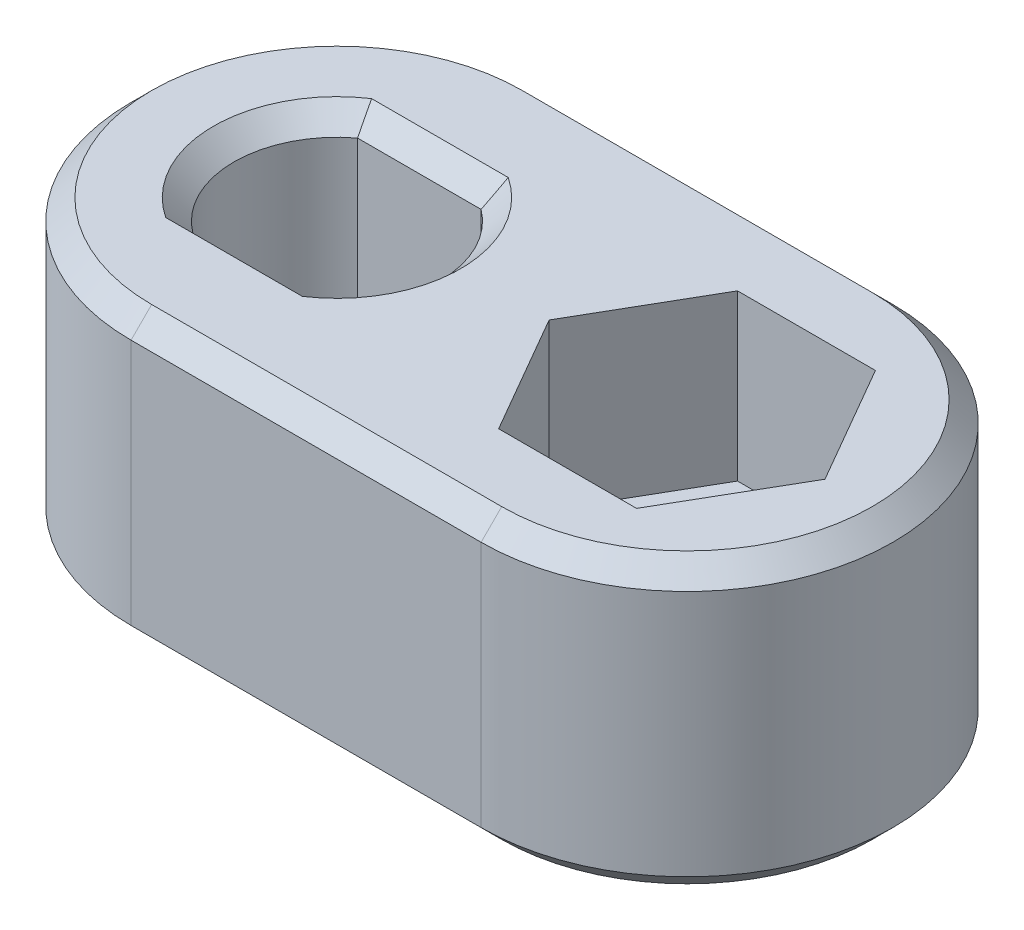
ISO-10303-21;
HEADER;
FILE_DESCRIPTION(('STEP AP214'),'2;1');
FILE_NAME('part.step','',(''),(''),'','','');
FILE_SCHEMA(('AUTOMOTIVE_DESIGN { 1 0 10303 214 1 1 1 1 }'));
ENDSEC;
DATA;
#1=APPLICATION_CONTEXT('core data for automotive mechanical design processes');
#2=APPLICATION_PROTOCOL_DEFINITION('international standard','automotive_design',2000,#1);
#3=PRODUCT_CONTEXT('',#1,'mechanical');
#4=PRODUCT('Part','Part','',(#3));
#5=PRODUCT_RELATED_PRODUCT_CATEGORY('part','',(#4));
#6=PRODUCT_DEFINITION_FORMATION('','',#4);
#7=PRODUCT_DEFINITION_CONTEXT('part definition',#1,'design');
#8=PRODUCT_DEFINITION('design','',#6,#7);
#9=PRODUCT_DEFINITION_SHAPE('','',#8);
#10=(LENGTH_UNIT() NAMED_UNIT(*) SI_UNIT(.MILLI.,.METRE.));
#11=(NAMED_UNIT(*) PLANE_ANGLE_UNIT() SI_UNIT($,.RADIAN.));
#12=(NAMED_UNIT(*) SI_UNIT($,.STERADIAN.) SOLID_ANGLE_UNIT());
#13=UNCERTAINTY_MEASURE_WITH_UNIT(LENGTH_MEASURE(1.E-05),#10,'distance_accuracy_value','');
#14=(GEOMETRIC_REPRESENTATION_CONTEXT(3) GLOBAL_UNCERTAINTY_ASSIGNED_CONTEXT((#13)) GLOBAL_UNIT_ASSIGNED_CONTEXT((#10,
#11,#12)) REPRESENTATION_CONTEXT('',''));
#15=CARTESIAN_POINT('',(0.,0.,0.));
#16=DIRECTION('',(0.,0.,1.));
#17=DIRECTION('',(1.,0.,0.));
#18=AXIS2_PLACEMENT_3D('',#15,#16,#17);
#19=CARTESIAN_POINT('',(8.5,0.,0.));
#20=DIRECTION('',(0.,-1.,0.));
#21=DIRECTION('',(0.,0.,-1.));
#22=AXIS2_PLACEMENT_3D('',#19,#20,#21);
#23=CYLINDRICAL_SURFACE('',#22,2.07500000000001);
#24=CARTESIAN_POINT('',(8.5,0.,0.));
#25=DIRECTION('',(0.,-1.,0.));
#26=DIRECTION('',(0.,0.,-1.));
#27=AXIS2_PLACEMENT_3D('',#24,#25,#26);
#28=CIRCLE('',#27,2.07500000000001);
#29=CARTESIAN_POINT('',(8.5,0.,-2.07500000000001));
#30=VERTEX_POINT('',#29);
#31=EDGE_CURVE('E236',#30,#30,#28,.T.);
#32=ORIENTED_EDGE('',*,*,#31,.T.);
#33=EDGE_LOOP('',(#32));
#34=FACE_BOUND('',#33,.T.);
#35=CARTESIAN_POINT('',(8.5,3.,0.));
#36=DIRECTION('',(0.,1.,0.));
#37=DIRECTION('',(0.,0.,1.));
#38=AXIS2_PLACEMENT_3D('',#35,#36,#37);
#39=CIRCLE('',#38,2.07500000000001);
#40=CARTESIAN_POINT('',(8.5,3.,2.07500000000001));
#41=VERTEX_POINT('',#40);
#42=EDGE_CURVE('E228',#41,#41,#39,.F.);
#43=ORIENTED_EDGE('',*,*,#42,.F.);
#44=EDGE_LOOP('',(#43));
#45=FACE_BOUND('',#44,.T.);
#46=ADVANCED_FACE('F35',(#34,#45),#23,.F.);
#47=CARTESIAN_POINT('',(0.,7.,0.));
#48=DIRECTION('',(0.,-1.,0.));
#49=DIRECTION('',(0.,0.,-1.));
#50=AXIS2_PLACEMENT_3D('',#47,#48,#49);
#51=CYLINDRICAL_SURFACE('',#50,5.);
#52=DIRECTION('',(0.,-1.,0.));
#53=VECTOR('',#52,1.);
#54=CARTESIAN_POINT('',(0.,7.,5.));
#55=LINE('',#54,#53);
#56=CARTESIAN_POINT('',(0.,6.5,5.));
#57=VERTEX_POINT('',#56);
#58=CARTESIAN_POINT('',(0.,0.500000000000005,5.));
#59=VERTEX_POINT('',#58);
#60=EDGE_CURVE('E276',#57,#59,#55,.T.);
#61=ORIENTED_EDGE('',*,*,#60,.F.);
#62=CARTESIAN_POINT('',(0.,6.5,0.));
#63=DIRECTION('',(0.,1.,0.));
#64=DIRECTION('',(0.,0.,1.));
#65=AXIS2_PLACEMENT_3D('',#62,#63,#64);
#66=CIRCLE('',#65,5.);
#67=CARTESIAN_POINT('',(0.,6.5,-5.));
#68=VERTEX_POINT('',#67);
#69=EDGE_CURVE('E312',#57,#68,#66,.F.);
#70=ORIENTED_EDGE('',*,*,#69,.T.);
#71=DIRECTION('',(0.,-1.,0.));
#72=VECTOR('',#71,1.);
#73=CARTESIAN_POINT('',(0.,7.,-5.));
#74=LINE('',#73,#72);
#75=CARTESIAN_POINT('',(0.,0.500000000000005,-5.));
#76=VERTEX_POINT('',#75);
#77=EDGE_CURVE('E259',#68,#76,#74,.T.);
#78=ORIENTED_EDGE('',*,*,#77,.T.);
#79=CARTESIAN_POINT('',(0.,0.500000000000005,0.));
#80=DIRECTION('',(0.,1.,0.));
#81=DIRECTION('',(0.,0.,1.));
#82=AXIS2_PLACEMENT_3D('',#79,#80,#81);
#83=CIRCLE('',#82,5.);
#84=EDGE_CURVE('E310',#76,#59,#83,.T.);
#85=ORIENTED_EDGE('',*,*,#84,.T.);
#86=EDGE_LOOP('',(#61,#70,#78,#85));
#87=FACE_BOUND('',#86,.T.);
#88=ADVANCED_FACE('F438',(#87),#51,.T.);
#89=CARTESIAN_POINT('',(0.,7.,5.));
#90=DIRECTION('',(0.,0.,-1.));
#91=DIRECTION('',(-1.,0.,0.));
#92=AXIS2_PLACEMENT_3D('',#89,#90,#91);
#93=PLANE('',#92);
#94=DIRECTION('',(0.,-1.,0.));
#95=VECTOR('',#94,1.);
#96=CARTESIAN_POINT('',(8.5,7.,5.));
#97=LINE('',#96,#95);
#98=CARTESIAN_POINT('',(8.5,6.5,5.));
#99=VERTEX_POINT('',#98);
#100=CARTESIAN_POINT('',(8.5,0.500000000000005,5.));
#101=VERTEX_POINT('',#100);
#102=EDGE_CURVE('E273',#99,#101,#97,.T.);
#103=ORIENTED_EDGE('',*,*,#102,.F.);
#104=DIRECTION('',(-1.,0.,0.));
#105=VECTOR('',#104,1.);
#106=CARTESIAN_POINT('',(0.,6.5,5.));
#107=LINE('',#106,#105);
#108=EDGE_CURVE('E317',#99,#57,#107,.T.);
#109=ORIENTED_EDGE('',*,*,#108,.T.);
#110=ORIENTED_EDGE('',*,*,#60,.T.);
#111=DIRECTION('',(1.,0.,0.));
#112=VECTOR('',#111,1.);
#113=CARTESIAN_POINT('',(0.,0.500000000000005,5.));
#114=LINE('',#113,#112);
#115=EDGE_CURVE('E315',#59,#101,#114,.T.);
#116=ORIENTED_EDGE('',*,*,#115,.T.);
#117=EDGE_LOOP('',(#103,#109,#110,#116));
#118=FACE_BOUND('',#117,.T.);
#119=ADVANCED_FACE('F445',(#118),#93,.F.);
#120=CARTESIAN_POINT('',(8.5,7.,0.));
#121=DIRECTION('',(0.,-1.,0.));
#122=DIRECTION('',(0.,0.,-1.));
#123=AXIS2_PLACEMENT_3D('',#120,#121,#122);
#124=CYLINDRICAL_SURFACE('',#123,5.);
#125=DIRECTION('',(0.,-1.,0.));
#126=VECTOR('',#125,1.);
#127=CARTESIAN_POINT('',(8.5,7.,-5.));
#128=LINE('',#127,#126);
#129=CARTESIAN_POINT('',(8.5,6.5,-5.));
#130=VERTEX_POINT('',#129);
#131=CARTESIAN_POINT('',(8.5,0.500000000000005,-5.));
#132=VERTEX_POINT('',#131);
#133=EDGE_CURVE('E270',#130,#132,#128,.T.);
#134=ORIENTED_EDGE('',*,*,#133,.F.);
#135=CARTESIAN_POINT('',(8.5,6.5,0.));
#136=DIRECTION('',(0.,1.,0.));
#137=DIRECTION('',(0.,0.,1.));
#138=AXIS2_PLACEMENT_3D('',#135,#136,#137);
#139=CIRCLE('',#138,5.);
#140=EDGE_CURVE('E326',#130,#99,#139,.F.);
#141=ORIENTED_EDGE('',*,*,#140,.T.);
#142=ORIENTED_EDGE('',*,*,#102,.T.);
#143=CARTESIAN_POINT('',(8.5,0.500000000000005,0.));
#144=DIRECTION('',(0.,1.,0.));
#145=DIRECTION('',(0.,0.,1.));
#146=AXIS2_PLACEMENT_3D('',#143,#144,#145);
#147=CIRCLE('',#146,5.);
#148=EDGE_CURVE('E323',#101,#132,#147,.T.);
#149=ORIENTED_EDGE('',*,*,#148,.T.);
#150=EDGE_LOOP('',(#134,#141,#142,#149));
#151=FACE_BOUND('',#150,.T.);
#152=ADVANCED_FACE('F486',(#151),#124,.T.);
#153=CARTESIAN_POINT('',(0.,7.,-5.));
#154=DIRECTION('',(0.,0.,1.));
#155=DIRECTION('',(1.,0.,0.));
#156=AXIS2_PLACEMENT_3D('',#153,#154,#155);
#157=PLANE('',#156);
#158=ORIENTED_EDGE('',*,*,#77,.F.);
#159=DIRECTION('',(1.,0.,0.));
#160=VECTOR('',#159,1.);
#161=CARTESIAN_POINT('',(8.5,6.5,-5.));
#162=LINE('',#161,#160);
#163=EDGE_CURVE('E321',#68,#130,#162,.T.);
#164=ORIENTED_EDGE('',*,*,#163,.T.);
#165=ORIENTED_EDGE('',*,*,#133,.T.);
#166=DIRECTION('',(-1.,0.,0.));
#167=VECTOR('',#166,1.);
#168=CARTESIAN_POINT('',(0.,0.500000000000005,-5.));
#169=LINE('',#168,#167);
#170=EDGE_CURVE('E319',#132,#76,#169,.T.);
#171=ORIENTED_EDGE('',*,*,#170,.T.);
#172=EDGE_LOOP('',(#158,#164,#165,#171));
#173=FACE_BOUND('',#172,.T.);
#174=ADVANCED_FACE('F480',(#173),#157,.F.);
#175=CARTESIAN_POINT('',(0.,7.,0.));
#176=DIRECTION('',(0.,1.,0.));
#177=DIRECTION('',(0.,0.,1.));
#178=AXIS2_PLACEMENT_3D('',#175,#176,#177);
#179=PLANE('',#178);
#180=CARTESIAN_POINT('',(0.,7.,0.));
#181=DIRECTION('',(0.,1.,0.));
#182=DIRECTION('',(0.,0.,1.));
#183=AXIS2_PLACEMENT_3D('',#180,#181,#182);
#184=CIRCLE('',#183,3.);
#185=CARTESIAN_POINT('',(-1.6583123951777,7.,2.5));
#186=VERTEX_POINT('',#185);
#187=CARTESIAN_POINT('',(-1.6583123951777,7.,-2.5));
#188=VERTEX_POINT('',#187);
#189=EDGE_CURVE('E296',#186,#188,#184,.F.);
#190=ORIENTED_EDGE('',*,*,#189,.T.);
#191=DIRECTION('',(1.,0.,0.));
#192=VECTOR('',#191,1.);
#193=CARTESIAN_POINT('',(0.,7.,-2.5));
#194=LINE('',#193,#192);
#195=CARTESIAN_POINT('',(1.6583123951777,7.,-2.5));
#196=VERTEX_POINT('',#195);
#197=EDGE_CURVE('E298',#188,#196,#194,.T.);
#198=ORIENTED_EDGE('',*,*,#197,.T.);
#199=CARTESIAN_POINT('',(0.,7.,0.));
#200=DIRECTION('',(0.,1.,0.));
#201=DIRECTION('',(0.,0.,1.));
#202=AXIS2_PLACEMENT_3D('',#199,#200,#201);
#203=CIRCLE('',#202,3.);
#204=CARTESIAN_POINT('',(1.6583123951777,7.,2.5));
#205=VERTEX_POINT('',#204);
#206=EDGE_CURVE('E292',#196,#205,#203,.F.);
#207=ORIENTED_EDGE('',*,*,#206,.T.);
#208=DIRECTION('',(-1.,0.,0.));
#209=VECTOR('',#208,1.);
#210=CARTESIAN_POINT('',(-1.5,7.,2.5));
#211=LINE('',#210,#209);
#212=EDGE_CURVE('E294',#205,#186,#211,.T.);
#213=ORIENTED_EDGE('',*,*,#212,.T.);
#214=EDGE_LOOP('',(#190,#198,#207,#213));
#215=FACE_BOUND('',#214,.T.);
#216=DIRECTION('',(-1.,0.,0.));
#217=VECTOR('',#216,1.);
#218=CARTESIAN_POINT('',(0.,7.,-4.5));
#219=LINE('',#218,#217);
#220=CARTESIAN_POINT('',(8.5,7.,-4.5));
#221=VERTEX_POINT('',#220);
#222=CARTESIAN_POINT('',(0.,7.,-4.5));
#223=VERTEX_POINT('',#222);
#224=EDGE_CURVE('E285',#221,#223,#219,.T.);
#225=ORIENTED_EDGE('',*,*,#224,.T.);
#226=CARTESIAN_POINT('',(0.,7.,0.));
#227=DIRECTION('',(0.,1.,0.));
#228=DIRECTION('',(0.,0.,1.));
#229=AXIS2_PLACEMENT_3D('',#226,#227,#228);
#230=CIRCLE('',#229,4.5);
#231=CARTESIAN_POINT('',(0.,7.,4.5));
#232=VERTEX_POINT('',#231);
#233=EDGE_CURVE('E289',#223,#232,#230,.T.);
#234=ORIENTED_EDGE('',*,*,#233,.T.);
#235=DIRECTION('',(1.,0.,0.));
#236=VECTOR('',#235,1.);
#237=CARTESIAN_POINT('',(8.5,7.,4.5));
#238=LINE('',#237,#236);
#239=CARTESIAN_POINT('',(8.5,7.,4.5));
#240=VERTEX_POINT('',#239);
#241=EDGE_CURVE('E287',#232,#240,#238,.T.);
#242=ORIENTED_EDGE('',*,*,#241,.T.);
#243=CARTESIAN_POINT('',(8.5,7.,0.));
#244=DIRECTION('',(0.,1.,0.));
#245=DIRECTION('',(0.,0.,1.));
#246=AXIS2_PLACEMENT_3D('',#243,#244,#245);
#247=CIRCLE('',#246,4.5);
#248=EDGE_CURVE('E279',#240,#221,#247,.T.);
#249=ORIENTED_EDGE('',*,*,#248,.T.);
#250=EDGE_LOOP('',(#225,#234,#242,#249));
#251=FACE_BOUND('',#250,.T.);
#252=DIRECTION('',(0.5,0.,-0.866025403784438));
#253=VECTOR('',#252,1.);
#254=CARTESIAN_POINT('',(10.1743157806499,7.,2.9));
#255=LINE('',#254,#253);
#256=CARTESIAN_POINT('',(10.1743157806499,7.,2.9));
#257=VERTEX_POINT('',#256);
#258=CARTESIAN_POINT('',(11.8486315612998,7.,0.));
#259=VERTEX_POINT('',#258);
#260=EDGE_CURVE('E182',#257,#259,#255,.T.);
#261=ORIENTED_EDGE('',*,*,#260,.F.);
#262=DIRECTION('',(1.,0.,0.));
#263=VECTOR('',#262,1.);
#264=CARTESIAN_POINT('',(6.82568421935009,7.,2.9));
#265=LINE('',#264,#263);
#266=CARTESIAN_POINT('',(6.82568421935009,7.,2.9));
#267=VERTEX_POINT('',#266);
#268=EDGE_CURVE('E201',#267,#257,#265,.T.);
#269=ORIENTED_EDGE('',*,*,#268,.F.);
#270=DIRECTION('',(0.5,0.,0.866025403784439));
#271=VECTOR('',#270,1.);
#272=CARTESIAN_POINT('',(5.15136843870017,7.,0.));
#273=LINE('',#272,#271);
#274=CARTESIAN_POINT('',(5.15136843870017,7.,0.));
#275=VERTEX_POINT('',#274);
#276=EDGE_CURVE('E204',#275,#267,#273,.T.);
#277=ORIENTED_EDGE('',*,*,#276,.F.);
#278=DIRECTION('',(-0.5,0.,0.866025403784439));
#279=VECTOR('',#278,1.);
#280=CARTESIAN_POINT('',(6.82568421935009,7.,-2.9));
#281=LINE('',#280,#279);
#282=CARTESIAN_POINT('',(6.82568421935009,7.,-2.9));
#283=VERTEX_POINT('',#282);
#284=EDGE_CURVE('E221',#283,#275,#281,.T.);
#285=ORIENTED_EDGE('',*,*,#284,.F.);
#286=DIRECTION('',(-1.,0.,0.));
#287=VECTOR('',#286,1.);
#288=CARTESIAN_POINT('',(10.1743157806499,7.,-2.9));
#289=LINE('',#288,#287);
#290=CARTESIAN_POINT('',(10.1743157806499,7.,-2.9));
#291=VERTEX_POINT('',#290);
#292=EDGE_CURVE('E218',#291,#283,#289,.T.);
#293=ORIENTED_EDGE('',*,*,#292,.F.);
#294=DIRECTION('',(-0.5,0.,-0.866025403784439));
#295=VECTOR('',#294,1.);
#296=CARTESIAN_POINT('',(11.8486315612998,7.,0.));
#297=LINE('',#296,#295);
#298=EDGE_CURVE('E215',#259,#291,#297,.T.);
#299=ORIENTED_EDGE('',*,*,#298,.F.);
#300=EDGE_LOOP('',(#261,#269,#277,#285,#293,#299));
#301=FACE_BOUND('',#300,.T.);
#302=ADVANCED_FACE('F476',(#215,#251,#301),#179,.T.);
#303=CARTESIAN_POINT('',(0.,0.,0.));
#304=DIRECTION('',(0.,1.,0.));
#305=DIRECTION('',(0.,0.,1.));
#306=AXIS2_PLACEMENT_3D('',#303,#304,#305);
#307=PLANE('',#306);
#308=DIRECTION('',(1.,0.,0.));
#309=VECTOR('',#308,1.);
#310=CARTESIAN_POINT('',(0.,0.,-4.49999999999999));
#311=LINE('',#310,#309);
#312=CARTESIAN_POINT('',(0.,0.,-4.49999999999999));
#313=VERTEX_POINT('',#312);
#314=CARTESIAN_POINT('',(8.5,0.,-4.49999999999999));
#315=VERTEX_POINT('',#314);
#316=EDGE_CURVE('E45',#313,#315,#311,.T.);
#317=ORIENTED_EDGE('',*,*,#316,.T.);
#318=CARTESIAN_POINT('',(8.5,0.,0.));
#319=DIRECTION('',(0.,1.,0.));
#320=DIRECTION('',(0.,0.,1.));
#321=AXIS2_PLACEMENT_3D('',#318,#319,#320);
#322=CIRCLE('',#321,4.49999999999999);
#323=CARTESIAN_POINT('',(8.5,0.,4.49999999999999));
#324=VERTEX_POINT('',#323);
#325=EDGE_CURVE('E11',#315,#324,#322,.F.);
#326=ORIENTED_EDGE('',*,*,#325,.T.);
#327=DIRECTION('',(-1.,0.,0.));
#328=VECTOR('',#327,1.);
#329=CARTESIAN_POINT('',(0.,0.,4.49999999999999));
#330=LINE('',#329,#328);
#331=CARTESIAN_POINT('',(0.,0.,4.49999999999999));
#332=VERTEX_POINT('',#331);
#333=EDGE_CURVE('E330',#324,#332,#330,.T.);
#334=ORIENTED_EDGE('',*,*,#333,.T.);
#335=CARTESIAN_POINT('',(0.,0.,0.));
#336=DIRECTION('',(0.,1.,0.));
#337=DIRECTION('',(0.,0.,1.));
#338=AXIS2_PLACEMENT_3D('',#335,#336,#337);
#339=CIRCLE('',#338,4.49999999999999);
#340=EDGE_CURVE('E328',#332,#313,#339,.F.);
#341=ORIENTED_EDGE('',*,*,#340,.T.);
#342=EDGE_LOOP('',(#317,#326,#334,#341));
#343=FACE_BOUND('',#342,.T.);
#344=ORIENTED_EDGE('',*,*,#31,.F.);
#345=EDGE_LOOP('',(#344));
#346=FACE_BOUND('',#345,.T.);
#347=CARTESIAN_POINT('',(0.,0.,0.));
#348=DIRECTION('',(0.,-1.,0.));
#349=DIRECTION('',(0.,0.,-1.));
#350=AXIS2_PLACEMENT_3D('',#347,#348,#349);
#351=CIRCLE('',#350,3.36);
#352=CARTESIAN_POINT('',(0.,0.,-3.36));
#353=VERTEX_POINT('',#352);
#354=EDGE_CURVE('E239',#353,#353,#351,.T.);
#355=ORIENTED_EDGE('',*,*,#354,.F.);
#356=EDGE_LOOP('',(#355));
#357=FACE_BOUND('',#356,.T.);
#358=ADVANCED_FACE('F479',(#343,#346,#357),#307,.F.);
#359=CARTESIAN_POINT('',(0.,3.,0.));
#360=DIRECTION('',(0.,1.,0.));
#361=DIRECTION('',(0.,0.,1.));
#362=AXIS2_PLACEMENT_3D('',#359,#360,#361);
#363=CYLINDRICAL_SURFACE('',#362,2.5);
#364=DIRECTION('',(0.,1.,0.));
#365=VECTOR('',#364,1.);
#366=CARTESIAN_POINT('',(-1.5,3.,-2.));
#367=LINE('',#366,#365);
#368=CARTESIAN_POINT('',(-1.5,3.,-2.));
#369=VERTEX_POINT('',#368);
#370=CARTESIAN_POINT('',(-1.5,6.5,-2.));
#371=VERTEX_POINT('',#370);
#372=EDGE_CURVE('E256',#369,#371,#367,.T.);
#373=ORIENTED_EDGE('',*,*,#372,.T.);
#374=CARTESIAN_POINT('',(0.,6.5,0.));
#375=DIRECTION('',(0.,1.,0.));
#376=DIRECTION('',(0.,0.,1.));
#377=AXIS2_PLACEMENT_3D('',#374,#375,#376);
#378=CIRCLE('',#377,2.5);
#379=CARTESIAN_POINT('',(-1.5,6.5,2.));
#380=VERTEX_POINT('',#379);
#381=EDGE_CURVE('E304',#371,#380,#378,.T.);
#382=ORIENTED_EDGE('',*,*,#381,.T.);
#383=DIRECTION('',(0.,1.,0.));
#384=VECTOR('',#383,1.);
#385=CARTESIAN_POINT('',(-1.5,3.,2.));
#386=LINE('',#385,#384);
#387=CARTESIAN_POINT('',(-1.5,3.,2.));
#388=VERTEX_POINT('',#387);
#389=EDGE_CURVE('E255',#388,#380,#386,.T.);
#390=ORIENTED_EDGE('',*,*,#389,.F.);
#391=CARTESIAN_POINT('',(0.,3.,0.));
#392=DIRECTION('',(0.,1.,0.));
#393=DIRECTION('',(0.,0.,1.));
#394=AXIS2_PLACEMENT_3D('',#391,#392,#393);
#395=CIRCLE('',#394,2.5);
#396=EDGE_CURVE('E246',#369,#388,#395,.T.);
#397=ORIENTED_EDGE('',*,*,#396,.F.);
#398=EDGE_LOOP('',(#373,#382,#390,#397));
#399=FACE_BOUND('',#398,.T.);
#400=ADVANCED_FACE('F468',(#399),#363,.F.);
#401=CARTESIAN_POINT('',(0.,3.,-2.));
#402=DIRECTION('',(0.,0.,1.));
#403=DIRECTION('',(1.,0.,0.));
#404=AXIS2_PLACEMENT_3D('',#401,#402,#403);
#405=PLANE('',#404);
#406=DIRECTION('',(0.,1.,0.));
#407=VECTOR('',#406,1.);
#408=CARTESIAN_POINT('',(1.5,3.,-2.));
#409=LINE('',#408,#407);
#410=CARTESIAN_POINT('',(1.5,3.,-2.));
#411=VERTEX_POINT('',#410);
#412=CARTESIAN_POINT('',(1.5,6.5,-2.));
#413=VERTEX_POINT('',#412);
#414=EDGE_CURVE('E260',#411,#413,#409,.T.);
#415=ORIENTED_EDGE('',*,*,#414,.T.);
#416=DIRECTION('',(-1.,0.,0.));
#417=VECTOR('',#416,1.);
#418=CARTESIAN_POINT('',(0.,6.5,-2.));
#419=LINE('',#418,#417);
#420=EDGE_CURVE('E301',#413,#371,#419,.T.);
#421=ORIENTED_EDGE('',*,*,#420,.T.);
#422=ORIENTED_EDGE('',*,*,#372,.F.);
#423=DIRECTION('',(1.,0.,0.));
#424=VECTOR('',#423,1.);
#425=CARTESIAN_POINT('',(0.,3.,-2.));
#426=LINE('',#425,#424);
#427=EDGE_CURVE('E253',#369,#411,#426,.T.);
#428=ORIENTED_EDGE('',*,*,#427,.T.);
#429=EDGE_LOOP('',(#415,#421,#422,#428));
#430=FACE_BOUND('',#429,.T.);
#431=ADVANCED_FACE('F464',(#430),#405,.T.);
#432=DIRECTION('',(0.,1.,0.));
#433=VECTOR('',#432,1.);
#434=CARTESIAN_POINT('',(1.5,3.,2.));
#435=LINE('',#434,#433);
#436=CARTESIAN_POINT('',(1.5,3.,2.));
#437=VERTEX_POINT('',#436);
#438=CARTESIAN_POINT('',(1.5,6.5,2.));
#439=VERTEX_POINT('',#438);
#440=EDGE_CURVE('E263',#437,#439,#435,.T.);
#441=ORIENTED_EDGE('',*,*,#440,.T.);
#442=CARTESIAN_POINT('',(0.,6.5,0.));
#443=DIRECTION('',(0.,1.,0.));
#444=DIRECTION('',(0.,0.,1.));
#445=AXIS2_PLACEMENT_3D('',#442,#443,#444);
#446=CIRCLE('',#445,2.5);
#447=EDGE_CURVE('E308',#439,#413,#446,.T.);
#448=ORIENTED_EDGE('',*,*,#447,.T.);
#449=ORIENTED_EDGE('',*,*,#414,.F.);
#450=EDGE_CURVE('E250',#437,#411,#395,.T.);
#451=ORIENTED_EDGE('',*,*,#450,.F.);
#452=EDGE_LOOP('',(#441,#448,#449,#451));
#453=FACE_BOUND('',#452,.T.);
#454=ADVANCED_FACE('F467',(#453),#363,.F.);
#455=CARTESIAN_POINT('',(0.,3.,2.));
#456=DIRECTION('',(0.,0.,1.));
#457=DIRECTION('',(1.,0.,0.));
#458=AXIS2_PLACEMENT_3D('',#455,#456,#457);
#459=PLANE('',#458);
#460=ORIENTED_EDGE('',*,*,#389,.T.);
#461=DIRECTION('',(1.,0.,0.));
#462=VECTOR('',#461,1.);
#463=CARTESIAN_POINT('',(1.5,6.5,2.));
#464=LINE('',#463,#462);
#465=EDGE_CURVE('E306',#380,#439,#464,.T.);
#466=ORIENTED_EDGE('',*,*,#465,.T.);
#467=ORIENTED_EDGE('',*,*,#440,.F.);
#468=DIRECTION('',(1.,0.,0.));
#469=VECTOR('',#468,1.);
#470=CARTESIAN_POINT('',(0.,3.,2.));
#471=LINE('',#470,#469);
#472=EDGE_CURVE('E249',#388,#437,#471,.T.);
#473=ORIENTED_EDGE('',*,*,#472,.F.);
#474=EDGE_LOOP('',(#460,#466,#467,#473));
#475=FACE_BOUND('',#474,.T.);
#476=ADVANCED_FACE('F462',(#475),#459,.F.);
#477=CARTESIAN_POINT('',(0.,3.,0.));
#478=DIRECTION('',(0.,1.,0.));
#479=DIRECTION('',(0.,0.,1.));
#480=AXIS2_PLACEMENT_3D('',#477,#478,#479);
#481=PLANE('',#480);
#482=CARTESIAN_POINT('',(0.,3.,0.));
#483=DIRECTION('',(0.,1.,0.));
#484=DIRECTION('',(0.,0.,1.));
#485=AXIS2_PLACEMENT_3D('',#482,#483,#484);
#486=CIRCLE('',#485,1.69999999999999);
#487=CARTESIAN_POINT('',(0.,3.,1.69999999999999));
#488=VERTEX_POINT('',#487);
#489=EDGE_CURVE('E245',#488,#488,#486,.T.);
#490=ORIENTED_EDGE('',*,*,#489,.F.);
#491=EDGE_LOOP('',(#490));
#492=FACE_BOUND('',#491,.T.);
#493=ORIENTED_EDGE('',*,*,#396,.T.);
#494=ORIENTED_EDGE('',*,*,#472,.T.);
#495=ORIENTED_EDGE('',*,*,#450,.T.);
#496=ORIENTED_EDGE('',*,*,#427,.F.);
#497=EDGE_LOOP('',(#493,#494,#495,#496));
#498=FACE_BOUND('',#497,.T.);
#499=ADVANCED_FACE('F458',(#492,#498),#481,.T.);
#500=CARTESIAN_POINT('',(0.,0.,0.));
#501=DIRECTION('',(0.,-1.,0.));
#502=DIRECTION('',(0.,0.,-1.));
#503=AXIS2_PLACEMENT_3D('',#500,#501,#502);
#504=CYLINDRICAL_SURFACE('',#503,1.69999999999999);
#505=ORIENTED_EDGE('',*,*,#489,.T.);
#506=EDGE_LOOP('',(#505));
#507=FACE_BOUND('',#506,.T.);
#508=CARTESIAN_POINT('',(0.,1.66000000000002,0.));
#509=DIRECTION('',(0.,-1.,0.));
#510=DIRECTION('',(0.,0.,-1.));
#511=AXIS2_PLACEMENT_3D('',#508,#509,#510);
#512=CIRCLE('',#511,1.69999999999999);
#513=CARTESIAN_POINT('',(0.,1.66000000000002,-1.69999999999999));
#514=VERTEX_POINT('',#513);
#515=EDGE_CURVE('E242',#514,#514,#512,.T.);
#516=ORIENTED_EDGE('',*,*,#515,.T.);
#517=EDGE_LOOP('',(#516));
#518=FACE_BOUND('',#517,.T.);
#519=ADVANCED_FACE('F454',(#507,#518),#504,.F.);
#520=CARTESIAN_POINT('',(0.,0.,0.));
#521=DIRECTION('',(0.,-1.,0.));
#522=DIRECTION('',(0.,0.,-1.));
#523=AXIS2_PLACEMENT_3D('',#520,#521,#522);
#524=CONICAL_SURFACE('',#523,3.36,0.785398163397445);
#525=ORIENTED_EDGE('',*,*,#515,.F.);
#526=EDGE_LOOP('',(#525));
#527=FACE_BOUND('',#526,.T.);
#528=ORIENTED_EDGE('',*,*,#354,.T.);
#529=EDGE_LOOP('',(#528));
#530=FACE_BOUND('',#529,.T.);
#531=ADVANCED_FACE('F451',(#527,#530),#524,.F.);
#532=CARTESIAN_POINT('',(0.,3.,0.));
#533=DIRECTION('',(0.,1.,0.));
#534=DIRECTION('',(0.,0.,1.));
#535=AXIS2_PLACEMENT_3D('',#532,#533,#534);
#536=PLANE('',#535);
#537=DIRECTION('',(0.5,0.,-0.866025403784438));
#538=VECTOR('',#537,1.);
#539=CARTESIAN_POINT('',(10.1743157806499,3.,2.9));
#540=LINE('',#539,#538);
#541=CARTESIAN_POINT('',(10.1743157806499,3.,2.9));
#542=VERTEX_POINT('',#541);
#543=CARTESIAN_POINT('',(11.8486315612998,3.,0.));
#544=VERTEX_POINT('',#543);
#545=EDGE_CURVE('E179',#542,#544,#540,.T.);
#546=ORIENTED_EDGE('',*,*,#545,.T.);
#547=DIRECTION('',(-0.5,0.,-0.866025403784439));
#548=VECTOR('',#547,1.);
#549=CARTESIAN_POINT('',(11.8486315612998,3.,0.));
#550=LINE('',#549,#548);
#551=CARTESIAN_POINT('',(10.1743157806499,3.,-2.9));
#552=VERTEX_POINT('',#551);
#553=EDGE_CURVE('E190',#544,#552,#550,.T.);
#554=ORIENTED_EDGE('',*,*,#553,.T.);
#555=DIRECTION('',(-1.,0.,0.));
#556=VECTOR('',#555,1.);
#557=CARTESIAN_POINT('',(10.1743157806499,3.,-2.9));
#558=LINE('',#557,#556);
#559=CARTESIAN_POINT('',(6.82568421935009,3.,-2.9));
#560=VERTEX_POINT('',#559);
#561=EDGE_CURVE('E195',#552,#560,#558,.T.);
#562=ORIENTED_EDGE('',*,*,#561,.T.);
#563=DIRECTION('',(-0.5,0.,0.866025403784439));
#564=VECTOR('',#563,1.);
#565=CARTESIAN_POINT('',(6.82568421935009,3.,-2.9));
#566=LINE('',#565,#564);
#567=CARTESIAN_POINT('',(5.15136843870017,3.,0.));
#568=VERTEX_POINT('',#567);
#569=EDGE_CURVE('E208',#560,#568,#566,.T.);
#570=ORIENTED_EDGE('',*,*,#569,.T.);
#571=DIRECTION('',(0.5,0.,0.866025403784439));
#572=VECTOR('',#571,1.);
#573=CARTESIAN_POINT('',(5.15136843870017,3.,0.));
#574=LINE('',#573,#572);
#575=CARTESIAN_POINT('',(6.82568421935009,3.,2.9));
#576=VERTEX_POINT('',#575);
#577=EDGE_CURVE('E211',#568,#576,#574,.T.);
#578=ORIENTED_EDGE('',*,*,#577,.T.);
#579=DIRECTION('',(1.,0.,0.));
#580=VECTOR('',#579,1.);
#581=CARTESIAN_POINT('',(6.82568421935009,3.,2.9));
#582=LINE('',#581,#580);
#583=EDGE_CURVE('E187',#576,#542,#582,.T.);
#584=ORIENTED_EDGE('',*,*,#583,.T.);
#585=EDGE_LOOP('',(#546,#554,#562,#570,#578,#584));
#586=FACE_BOUND('',#585,.T.);
#587=ORIENTED_EDGE('',*,*,#42,.T.);
#588=EDGE_LOOP('',(#587));
#589=FACE_BOUND('',#588,.T.);
#590=ADVANCED_FACE('F197',(#586,#589),#536,.T.);
#591=CARTESIAN_POINT('',(10.1743157806499,3.,2.9));
#592=DIRECTION('',(0.866025403784439,0.,0.5));
#593=DIRECTION('',(0.5,0.,-0.866025403784438));
#594=AXIS2_PLACEMENT_3D('',#591,#592,#593);
#595=PLANE('',#594);
#596=ORIENTED_EDGE('',*,*,#260,.T.);
#597=DIRECTION('',(0.,1.,0.));
#598=VECTOR('',#597,1.);
#599=CARTESIAN_POINT('',(11.8486315612998,3.,0.));
#600=LINE('',#599,#598);
#601=EDGE_CURVE('E175',#544,#259,#600,.T.);
#602=ORIENTED_EDGE('',*,*,#601,.F.);
#603=ORIENTED_EDGE('',*,*,#545,.F.);
#604=DIRECTION('',(0.,1.,0.));
#605=VECTOR('',#604,1.);
#606=CARTESIAN_POINT('',(10.1743157806499,3.,2.9));
#607=LINE('',#606,#605);
#608=EDGE_CURVE('E226',#542,#257,#607,.T.);
#609=ORIENTED_EDGE('',*,*,#608,.T.);
#610=EDGE_LOOP('',(#596,#602,#603,#609));
#611=FACE_BOUND('',#610,.T.);
#612=ADVANCED_FACE('F177',(#611),#595,.F.);
#613=CARTESIAN_POINT('',(6.82568421935009,3.,2.9));
#614=DIRECTION('',(0.,0.,1.));
#615=DIRECTION('',(1.,0.,0.));
#616=AXIS2_PLACEMENT_3D('',#613,#614,#615);
#617=PLANE('',#616);
#618=ORIENTED_EDGE('',*,*,#268,.T.);
#619=ORIENTED_EDGE('',*,*,#608,.F.);
#620=ORIENTED_EDGE('',*,*,#583,.F.);
#621=DIRECTION('',(0.,1.,0.));
#622=VECTOR('',#621,1.);
#623=CARTESIAN_POINT('',(6.82568421935009,3.,2.9));
#624=LINE('',#623,#622);
#625=EDGE_CURVE('E229',#576,#267,#624,.T.);
#626=ORIENTED_EDGE('',*,*,#625,.T.);
#627=EDGE_LOOP('',(#618,#619,#620,#626));
#628=FACE_BOUND('',#627,.T.);
#629=ADVANCED_FACE('F551',(#628),#617,.F.);
#630=CARTESIAN_POINT('',(5.15136843870017,3.,0.));
#631=DIRECTION('',(-0.866025403784439,0.,0.5));
#632=DIRECTION('',(0.5,0.,0.866025403784439));
#633=AXIS2_PLACEMENT_3D('',#630,#631,#632);
#634=PLANE('',#633);
#635=ORIENTED_EDGE('',*,*,#276,.T.);
#636=ORIENTED_EDGE('',*,*,#625,.F.);
#637=ORIENTED_EDGE('',*,*,#577,.F.);
#638=DIRECTION('',(0.,1.,0.));
#639=VECTOR('',#638,1.);
#640=CARTESIAN_POINT('',(5.15136843870017,3.,0.));
#641=LINE('',#640,#639);
#642=EDGE_CURVE('E231',#568,#275,#641,.T.);
#643=ORIENTED_EDGE('',*,*,#642,.T.);
#644=EDGE_LOOP('',(#635,#636,#637,#643));
#645=FACE_BOUND('',#644,.T.);
#646=ADVANCED_FACE('F549',(#645),#634,.F.);
#647=CARTESIAN_POINT('',(6.82568421935009,3.,-2.9));
#648=DIRECTION('',(-0.866025403784439,0.,-0.5));
#649=DIRECTION('',(-0.5,0.,0.866025403784439));
#650=AXIS2_PLACEMENT_3D('',#647,#648,#649);
#651=PLANE('',#650);
#652=ORIENTED_EDGE('',*,*,#284,.T.);
#653=ORIENTED_EDGE('',*,*,#642,.F.);
#654=ORIENTED_EDGE('',*,*,#569,.F.);
#655=DIRECTION('',(0.,1.,0.));
#656=VECTOR('',#655,1.);
#657=CARTESIAN_POINT('',(6.82568421935009,3.,-2.9));
#658=LINE('',#657,#656);
#659=EDGE_CURVE('E233',#560,#283,#658,.T.);
#660=ORIENTED_EDGE('',*,*,#659,.T.);
#661=EDGE_LOOP('',(#652,#653,#654,#660));
#662=FACE_BOUND('',#661,.T.);
#663=ADVANCED_FACE('F547',(#662),#651,.F.);
#664=CARTESIAN_POINT('',(10.1743157806499,3.,-2.9));
#665=DIRECTION('',(0.,0.,-1.));
#666=DIRECTION('',(-1.,0.,0.));
#667=AXIS2_PLACEMENT_3D('',#664,#665,#666);
#668=PLANE('',#667);
#669=ORIENTED_EDGE('',*,*,#292,.T.);
#670=ORIENTED_EDGE('',*,*,#659,.F.);
#671=ORIENTED_EDGE('',*,*,#561,.F.);
#672=DIRECTION('',(0.,1.,0.));
#673=VECTOR('',#672,1.);
#674=CARTESIAN_POINT('',(10.1743157806499,3.,-2.9));
#675=LINE('',#674,#673);
#676=EDGE_CURVE('E186',#552,#291,#675,.T.);
#677=ORIENTED_EDGE('',*,*,#676,.T.);
#678=EDGE_LOOP('',(#669,#670,#671,#677));
#679=FACE_BOUND('',#678,.T.);
#680=ADVANCED_FACE('F543',(#679),#668,.F.);
#681=CARTESIAN_POINT('',(11.8486315612998,3.,0.));
#682=DIRECTION('',(0.866025403784439,0.,-0.5));
#683=DIRECTION('',(-0.5,0.,-0.866025403784439));
#684=AXIS2_PLACEMENT_3D('',#681,#682,#683);
#685=PLANE('',#684);
#686=ORIENTED_EDGE('',*,*,#298,.T.);
#687=ORIENTED_EDGE('',*,*,#676,.F.);
#688=ORIENTED_EDGE('',*,*,#553,.F.);
#689=ORIENTED_EDGE('',*,*,#601,.T.);
#690=EDGE_LOOP('',(#686,#687,#688,#689));
#691=FACE_BOUND('',#690,.T.);
#692=ADVANCED_FACE('F191',(#691),#685,.F.);
#693=CARTESIAN_POINT('',(0.,6.5,2.));
#694=DIRECTION('',(0.,0.707106781186549,-0.707106781186546));
#695=DIRECTION('',(-1.,0.,0.));
#696=AXIS2_PLACEMENT_3D('',#693,#694,#695);
#697=PLANE('',#696);
#698=CARTESIAN_POINT('',(1.5,6.5,2.));
#699=CARTESIAN_POINT('',(1.52764420802877,6.58313427543744,2.08313427543744));
#700=CARTESIAN_POINT('',(1.55465904424928,6.66636818822682,2.16636818822683));
#701=CARTESIAN_POINT('',(1.60742983610777,6.83303485592792,2.33303485592792));
#702=CARTESIAN_POINT('',(1.63318579827982,6.9164676098052,2.4164676098052));
#703=CARTESIAN_POINT('',(1.6583123951777,7.,2.5));
#704=B_SPLINE_CURVE_WITH_KNOTS('',3,(#698,#699,#700,#701,#702,#703),.UNSPECIFIED.,.F.,.F.,(4,2,
4),(0.,0.362312197796799,0.724622514843559),.UNSPECIFIED.);
#705=EDGE_CURVE('E365',#439,#205,#704,.T.);
#706=ORIENTED_EDGE('',*,*,#705,.F.);
#707=ORIENTED_EDGE('',*,*,#465,.F.);
#708=CARTESIAN_POINT('',(-1.5,6.5,2.));
#709=CARTESIAN_POINT('',(-1.52764420802877,6.58313427543744,2.08313427543744));
#710=CARTESIAN_POINT('',(-1.55465904424928,6.66636818822682,2.16636818822683));
#711=CARTESIAN_POINT('',(-1.60742983610777,6.83303485592792,2.33303485592792));
#712=CARTESIAN_POINT('',(-1.63318579827982,6.9164676098052,2.4164676098052));
#713=CARTESIAN_POINT('',(-1.6583123951777,7.,2.5));
#714=B_SPLINE_CURVE_WITH_KNOTS('',3,(#708,#709,#710,#711,#712,#713),.UNSPECIFIED.,.F.,.F.,(4,2,
4),(0.,0.362312197796799,0.724622514843559),.UNSPECIFIED.);
#715=EDGE_CURVE('E216',#186,#380,#714,.F.);
#716=ORIENTED_EDGE('',*,*,#715,.F.);
#717=ORIENTED_EDGE('',*,*,#212,.F.);
#718=EDGE_LOOP('',(#706,#707,#716,#717));
#719=FACE_BOUND('',#718,.T.);
#720=ADVANCED_FACE('F378',(#719),#697,.T.);
#721=CARTESIAN_POINT('',(0.,6.5,0.));
#722=DIRECTION('',(0.,1.,0.));
#723=DIRECTION('',(0.,0.,1.));
#724=AXIS2_PLACEMENT_3D('',#721,#722,#723);
#725=CONICAL_SURFACE('',#724,2.5,0.78539816339745);
#726=ORIENTED_EDGE('',*,*,#715,.T.);
#727=ORIENTED_EDGE('',*,*,#381,.F.);
#728=CARTESIAN_POINT('',(-1.5,6.5,-2.));
#729=CARTESIAN_POINT('',(-1.52764420802877,6.58313427543744,-2.08313427543744));
#730=CARTESIAN_POINT('',(-1.55465904424928,6.66636818822682,-2.16636818822683));
#731=CARTESIAN_POINT('',(-1.60742983610777,6.83303485592792,-2.33303485592792));
#732=CARTESIAN_POINT('',(-1.63318579827982,6.9164676098052,-2.4164676098052));
#733=CARTESIAN_POINT('',(-1.6583123951777,7.,-2.5));
#734=B_SPLINE_CURVE_WITH_KNOTS('',3,(#728,#729,#730,#731,#732,#733),.UNSPECIFIED.,.F.,.F.,(4,2,
4),(0.,0.362312197796799,0.724622514843559),.UNSPECIFIED.);
#735=EDGE_CURVE('E341',#188,#371,#734,.F.);
#736=ORIENTED_EDGE('',*,*,#735,.F.);
#737=ORIENTED_EDGE('',*,*,#189,.F.);
#738=EDGE_LOOP('',(#726,#727,#736,#737));
#739=FACE_BOUND('',#738,.T.);
#740=ADVANCED_FACE('F360',(#739),#725,.F.);
#741=CARTESIAN_POINT('',(0.,6.5,0.));
#742=DIRECTION('',(0.,1.,0.));
#743=DIRECTION('',(0.,0.,1.));
#744=AXIS2_PLACEMENT_3D('',#741,#742,#743);
#745=CONICAL_SURFACE('',#744,2.5,0.78539816339745);
#746=ORIENTED_EDGE('',*,*,#705,.T.);
#747=ORIENTED_EDGE('',*,*,#206,.F.);
#748=CARTESIAN_POINT('',(1.6583123951777,7.,-2.5));
#749=CARTESIAN_POINT('',(1.63318579827982,6.9164676098052,-2.4164676098052));
#750=CARTESIAN_POINT('',(1.60742983610777,6.83303485592792,-2.33303485592792));
#751=CARTESIAN_POINT('',(1.55465904424928,6.66636818822682,-2.16636818822683));
#752=CARTESIAN_POINT('',(1.52764420802877,6.58313427543744,-2.08313427543744));
#753=CARTESIAN_POINT('',(1.5,6.5,-2.));
#754=B_SPLINE_CURVE_WITH_KNOTS('',3,(#748,#749,#750,#751,#752,#753),.UNSPECIFIED.,.F.,.F.,(4,2,
4),(0.,0.36231031704676,0.724622514843559),.UNSPECIFIED.);
#755=EDGE_CURVE('E333',#413,#196,#754,.F.);
#756=ORIENTED_EDGE('',*,*,#755,.F.);
#757=ORIENTED_EDGE('',*,*,#447,.F.);
#758=EDGE_LOOP('',(#746,#747,#756,#757));
#759=FACE_BOUND('',#758,.T.);
#760=ADVANCED_FACE('F354',(#759),#745,.F.);
#761=CARTESIAN_POINT('',(0.,7.,-2.5));
#762=DIRECTION('',(0.,-0.707106781186549,-0.707106781186546));
#763=DIRECTION('',(1.,0.,0.));
#764=AXIS2_PLACEMENT_3D('',#761,#762,#763);
#765=PLANE('',#764);
#766=ORIENTED_EDGE('',*,*,#735,.T.);
#767=ORIENTED_EDGE('',*,*,#420,.F.);
#768=ORIENTED_EDGE('',*,*,#755,.T.);
#769=ORIENTED_EDGE('',*,*,#197,.F.);
#770=EDGE_LOOP('',(#766,#767,#768,#769));
#771=FACE_BOUND('',#770,.T.);
#772=ADVANCED_FACE('F350',(#771),#765,.F.);
#773=CARTESIAN_POINT('',(8.5,7.,0.));
#774=DIRECTION('',(0.,-1.,0.));
#775=DIRECTION('',(0.,0.,-1.));
#776=AXIS2_PLACEMENT_3D('',#773,#774,#775);
#777=CONICAL_SURFACE('',#776,4.5,0.785398163397449);
#778=DIRECTION('',(0.,0.707106781186547,-0.707106781186548));
#779=VECTOR('',#778,1.);
#780=CARTESIAN_POINT('',(8.5,6.5,5.));
#781=LINE('',#780,#779);
#782=EDGE_CURVE('E503',#99,#240,#781,.T.);
#783=ORIENTED_EDGE('',*,*,#782,.F.);
#784=ORIENTED_EDGE('',*,*,#140,.F.);
#785=DIRECTION('',(0.,-0.707106781186547,-0.707106781186548));
#786=VECTOR('',#785,1.);
#787=CARTESIAN_POINT('',(8.5,7.,-4.5));
#788=LINE('',#787,#786);
#789=EDGE_CURVE('E342',#221,#130,#788,.T.);
#790=ORIENTED_EDGE('',*,*,#789,.F.);
#791=ORIENTED_EDGE('',*,*,#248,.F.);
#792=EDGE_LOOP('',(#783,#784,#790,#791));
#793=FACE_BOUND('',#792,.T.);
#794=ADVANCED_FACE('F407',(#793),#777,.T.);
#795=CARTESIAN_POINT('',(0.,7.,-4.5));
#796=DIRECTION('',(0.,0.707106781186548,-0.707106781186547));
#797=DIRECTION('',(1.,0.,0.));
#798=AXIS2_PLACEMENT_3D('',#795,#796,#797);
#799=PLANE('',#798);
#800=ORIENTED_EDGE('',*,*,#789,.T.);
#801=ORIENTED_EDGE('',*,*,#163,.F.);
#802=DIRECTION('',(0.,-0.707106781186547,-0.707106781186548));
#803=VECTOR('',#802,1.);
#804=CARTESIAN_POINT('',(0.,7.,-4.5));
#805=LINE('',#804,#803);
#806=EDGE_CURVE('E507',#223,#68,#805,.T.);
#807=ORIENTED_EDGE('',*,*,#806,.F.);
#808=ORIENTED_EDGE('',*,*,#224,.F.);
#809=EDGE_LOOP('',(#800,#801,#807,#808));
#810=FACE_BOUND('',#809,.T.);
#811=ADVANCED_FACE('F400',(#810),#799,.T.);
#812=CARTESIAN_POINT('',(0.,7.,4.5));
#813=DIRECTION('',(0.,0.707106781186548,0.707106781186547));
#814=DIRECTION('',(-1.,0.,0.));
#815=AXIS2_PLACEMENT_3D('',#812,#813,#814);
#816=PLANE('',#815);
#817=ORIENTED_EDGE('',*,*,#782,.T.);
#818=ORIENTED_EDGE('',*,*,#241,.F.);
#819=DIRECTION('',(0.,0.707106781186547,-0.707106781186548));
#820=VECTOR('',#819,1.);
#821=CARTESIAN_POINT('',(0.,6.5,5.));
#822=LINE('',#821,#820);
#823=EDGE_CURVE('E510',#57,#232,#822,.T.);
#824=ORIENTED_EDGE('',*,*,#823,.F.);
#825=ORIENTED_EDGE('',*,*,#108,.F.);
#826=EDGE_LOOP('',(#817,#818,#824,#825));
#827=FACE_BOUND('',#826,.T.);
#828=ADVANCED_FACE('F393',(#827),#816,.T.);
#829=CARTESIAN_POINT('',(0.,7.,0.));
#830=DIRECTION('',(0.,-1.,0.));
#831=DIRECTION('',(0.,0.,-1.));
#832=AXIS2_PLACEMENT_3D('',#829,#830,#831);
#833=CONICAL_SURFACE('',#832,4.5,0.785398163397449);
#834=ORIENTED_EDGE('',*,*,#806,.T.);
#835=ORIENTED_EDGE('',*,*,#69,.F.);
#836=ORIENTED_EDGE('',*,*,#823,.T.);
#837=ORIENTED_EDGE('',*,*,#233,.F.);
#838=EDGE_LOOP('',(#834,#835,#836,#837));
#839=FACE_BOUND('',#838,.T.);
#840=ADVANCED_FACE('F386',(#839),#833,.T.);
#841=CARTESIAN_POINT('',(0.,0.500000000000005,0.));
#842=DIRECTION('',(0.,1.,0.));
#843=DIRECTION('',(0.,0.,1.));
#844=AXIS2_PLACEMENT_3D('',#841,#842,#843);
#845=CONICAL_SURFACE('',#844,5.,0.785398163397452);
#846=DIRECTION('',(0.,0.707106781186545,-0.70710678118655));
#847=VECTOR('',#846,1.);
#848=CARTESIAN_POINT('',(0.,0.,-4.49999999999999));
#849=LINE('',#848,#847);
#850=EDGE_CURVE('E514',#313,#76,#849,.T.);
#851=ORIENTED_EDGE('',*,*,#850,.F.);
#852=ORIENTED_EDGE('',*,*,#340,.F.);
#853=DIRECTION('',(0.,-0.707106781186545,-0.70710678118655));
#854=VECTOR('',#853,1.);
#855=CARTESIAN_POINT('',(0.,0.500000000000005,5.));
#856=LINE('',#855,#854);
#857=EDGE_CURVE('E40',#59,#332,#856,.T.);
#858=ORIENTED_EDGE('',*,*,#857,.F.);
#859=ORIENTED_EDGE('',*,*,#84,.F.);
#860=EDGE_LOOP('',(#851,#852,#858,#859));
#861=FACE_BOUND('',#860,.T.);
#862=ADVANCED_FACE('F38',(#861),#845,.T.);
#863=CARTESIAN_POINT('',(0.,0.500000000000005,5.));
#864=DIRECTION('',(0.,0.70710678118655,-0.707106781186545));
#865=DIRECTION('',(1.,0.,0.));
#866=AXIS2_PLACEMENT_3D('',#863,#864,#865);
#867=PLANE('',#866);
#868=ORIENTED_EDGE('',*,*,#857,.T.);
#869=ORIENTED_EDGE('',*,*,#333,.F.);
#870=DIRECTION('',(0.,-0.707106781186545,-0.70710678118655));
#871=VECTOR('',#870,1.);
#872=CARTESIAN_POINT('',(8.5,0.500000000000005,5.));
#873=LINE('',#872,#871);
#874=EDGE_CURVE('E58',#101,#324,#873,.T.);
#875=ORIENTED_EDGE('',*,*,#874,.F.);
#876=ORIENTED_EDGE('',*,*,#115,.F.);
#877=EDGE_LOOP('',(#868,#869,#875,#876));
#878=FACE_BOUND('',#877,.T.);
#879=ADVANCED_FACE('F426',(#878),#867,.F.);
#880=CARTESIAN_POINT('',(0.,0.500000000000005,-5.));
#881=DIRECTION('',(0.,0.70710678118655,0.707106781186545));
#882=DIRECTION('',(-1.,0.,0.));
#883=AXIS2_PLACEMENT_3D('',#880,#881,#882);
#884=PLANE('',#883);
#885=ORIENTED_EDGE('',*,*,#850,.T.);
#886=ORIENTED_EDGE('',*,*,#170,.F.);
#887=DIRECTION('',(0.,0.707106781186545,-0.70710678118655));
#888=VECTOR('',#887,1.);
#889=CARTESIAN_POINT('',(8.5,0.,-4.49999999999999));
#890=LINE('',#889,#888);
#891=EDGE_CURVE('E517',#315,#132,#890,.T.);
#892=ORIENTED_EDGE('',*,*,#891,.F.);
#893=ORIENTED_EDGE('',*,*,#316,.F.);
#894=EDGE_LOOP('',(#885,#886,#892,#893));
#895=FACE_BOUND('',#894,.T.);
#896=ADVANCED_FACE('F421',(#895),#884,.F.);
#897=CARTESIAN_POINT('',(8.5,0.500000000000005,0.));
#898=DIRECTION('',(0.,1.,0.));
#899=DIRECTION('',(0.,0.,1.));
#900=AXIS2_PLACEMENT_3D('',#897,#898,#899);
#901=CONICAL_SURFACE('',#900,5.,0.785398163397452);
#902=ORIENTED_EDGE('',*,*,#874,.T.);
#903=ORIENTED_EDGE('',*,*,#325,.F.);
#904=ORIENTED_EDGE('',*,*,#891,.T.);
#905=ORIENTED_EDGE('',*,*,#148,.F.);
#906=EDGE_LOOP('',(#902,#903,#904,#905));
#907=FACE_BOUND('',#906,.T.);
#908=ADVANCED_FACE('F415',(#907),#901,.T.);
#909=CLOSED_SHELL('',(#46,#88,#119,#152,#174,#302,#358,#400,#431,#454,#476,#499,#519,#531,#590,
#612,#629,#646,#663,#680,#692,#720,#740,#760,#772,#794,#811,#828,#840,#862,#879,#896,#908));
#910=MANIFOLD_SOLID_BREP('B2',#909);
#911=ADVANCED_BREP_SHAPE_REPRESENTATION('',(#18,#910),#14);
#912=SHAPE_DEFINITION_REPRESENTATION(#9,#911);
ENDSEC;
END-ISO-10303-21;
